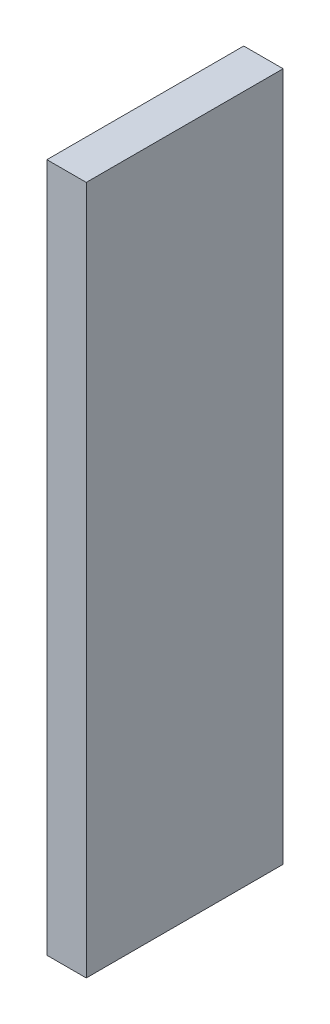
ISO-10303-21;
HEADER;
FILE_DESCRIPTION(('STEP AP214'),'2;1');
FILE_NAME('part.step','',(''),(''),'','','');
FILE_SCHEMA(('AUTOMOTIVE_DESIGN { 1 0 10303 214 1 1 1 1 }'));
ENDSEC;
DATA;
#1=APPLICATION_CONTEXT('core data for automotive mechanical design processes');
#2=APPLICATION_PROTOCOL_DEFINITION('international standard','automotive_design',2000,#1);
#3=PRODUCT_CONTEXT('',#1,'mechanical');
#4=PRODUCT('Part','Part','',(#3));
#5=PRODUCT_RELATED_PRODUCT_CATEGORY('part','',(#4));
#6=PRODUCT_DEFINITION_FORMATION('','',#4);
#7=PRODUCT_DEFINITION_CONTEXT('part definition',#1,'design');
#8=PRODUCT_DEFINITION('design','',#6,#7);
#9=PRODUCT_DEFINITION_SHAPE('','',#8);
#10=(LENGTH_UNIT() NAMED_UNIT(*) SI_UNIT(.MILLI.,.METRE.));
#11=(NAMED_UNIT(*) PLANE_ANGLE_UNIT() SI_UNIT($,.RADIAN.));
#12=(NAMED_UNIT(*) SI_UNIT($,.STERADIAN.) SOLID_ANGLE_UNIT());
#13=UNCERTAINTY_MEASURE_WITH_UNIT(LENGTH_MEASURE(1.E-05),#10,'distance_accuracy_value','');
#14=(GEOMETRIC_REPRESENTATION_CONTEXT(3) GLOBAL_UNCERTAINTY_ASSIGNED_CONTEXT((#13)) GLOBAL_UNIT_ASSIGNED_CONTEXT((#10,
#11,#12)) REPRESENTATION_CONTEXT('',''));
#15=CARTESIAN_POINT('',(0.,0.,0.));
#16=DIRECTION('',(0.,0.,1.));
#17=DIRECTION('',(1.,0.,0.));
#18=AXIS2_PLACEMENT_3D('',#15,#16,#17);
#19=CARTESIAN_POINT('',(0.,35.,20.));
#20=DIRECTION('',(-1.,0.,0.));
#21=DIRECTION('',(0.,0.,1.));
#22=AXIS2_PLACEMENT_3D('',#19,#20,#21);
#23=PLANE('',#22);
#24=DIRECTION('',(0.,1.,0.));
#25=VECTOR('',#24,1.);
#26=CARTESIAN_POINT('',(0.,35.,0.));
#27=LINE('',#26,#25);
#28=CARTESIAN_POINT('',(0.,-35.,0.));
#29=VERTEX_POINT('',#28);
#30=CARTESIAN_POINT('',(0.,35.,0.));
#31=VERTEX_POINT('',#30);
#32=EDGE_CURVE('E107',#29,#31,#27,.T.);
#33=ORIENTED_EDGE('',*,*,#32,.T.);
#34=DIRECTION('',(0.,0.,-1.));
#35=VECTOR('',#34,1.);
#36=CARTESIAN_POINT('',(0.,35.,20.));
#37=LINE('',#36,#35);
#38=CARTESIAN_POINT('',(0.,35.,20.));
#39=VERTEX_POINT('',#38);
#40=EDGE_CURVE('E11',#39,#31,#37,.T.);
#41=ORIENTED_EDGE('',*,*,#40,.F.);
#42=DIRECTION('',(0.,1.,0.));
#43=VECTOR('',#42,1.);
#44=CARTESIAN_POINT('',(0.,35.,20.));
#45=LINE('',#44,#43);
#46=CARTESIAN_POINT('',(0.,-35.,20.));
#47=VERTEX_POINT('',#46);
#48=EDGE_CURVE('E91',#47,#39,#45,.T.);
#49=ORIENTED_EDGE('',*,*,#48,.F.);
#50=DIRECTION('',(0.,0.,-1.));
#51=VECTOR('',#50,1.);
#52=CARTESIAN_POINT('',(0.,-35.,20.));
#53=LINE('',#52,#51);
#54=EDGE_CURVE('E103',#47,#29,#53,.T.);
#55=ORIENTED_EDGE('',*,*,#54,.T.);
#56=EDGE_LOOP('',(#33,#41,#49,#55));
#57=FACE_BOUND('',#56,.T.);
#58=ADVANCED_FACE('F39',(#57),#23,.F.);
#59=CARTESIAN_POINT('',(0.,35.,20.));
#60=DIRECTION('',(0.,-1.,0.));
#61=DIRECTION('',(0.,0.,-1.));
#62=AXIS2_PLACEMENT_3D('',#59,#60,#61);
#63=PLANE('',#62);
#64=DIRECTION('',(-1.,0.,0.));
#65=VECTOR('',#64,1.);
#66=CARTESIAN_POINT('',(0.,35.,0.));
#67=LINE('',#66,#65);
#68=CARTESIAN_POINT('',(-4.,35.,0.));
#69=VERTEX_POINT('',#68);
#70=EDGE_CURVE('E96',#31,#69,#67,.T.);
#71=ORIENTED_EDGE('',*,*,#70,.T.);
#72=DIRECTION('',(0.,0.,-1.));
#73=VECTOR('',#72,1.);
#74=CARTESIAN_POINT('',(-4.,35.,20.));
#75=LINE('',#74,#73);
#76=CARTESIAN_POINT('',(-4.,35.,20.));
#77=VERTEX_POINT('',#76);
#78=EDGE_CURVE('E48',#77,#69,#75,.T.);
#79=ORIENTED_EDGE('',*,*,#78,.F.);
#80=DIRECTION('',(-1.,0.,0.));
#81=VECTOR('',#80,1.);
#82=CARTESIAN_POINT('',(0.,35.,20.));
#83=LINE('',#82,#81);
#84=EDGE_CURVE('E86',#39,#77,#83,.T.);
#85=ORIENTED_EDGE('',*,*,#84,.F.);
#86=ORIENTED_EDGE('',*,*,#40,.T.);
#87=EDGE_LOOP('',(#71,#79,#85,#86));
#88=FACE_BOUND('',#87,.T.);
#89=ADVANCED_FACE('F95',(#88),#63,.F.);
#90=CARTESIAN_POINT('',(-4.,35.,20.));
#91=DIRECTION('',(1.,0.,0.));
#92=DIRECTION('',(0.,1.,0.));
#93=AXIS2_PLACEMENT_3D('',#90,#91,#92);
#94=PLANE('',#93);
#95=DIRECTION('',(0.,-1.,0.));
#96=VECTOR('',#95,1.);
#97=CARTESIAN_POINT('',(-4.,35.,0.));
#98=LINE('',#97,#96);
#99=CARTESIAN_POINT('',(-4.00000000000001,-35.,0.));
#100=VERTEX_POINT('',#99);
#101=EDGE_CURVE('E73',#69,#100,#98,.T.);
#102=ORIENTED_EDGE('',*,*,#101,.T.);
#103=DIRECTION('',(0.,0.,-1.));
#104=VECTOR('',#103,1.);
#105=CARTESIAN_POINT('',(-4.00000000000001,-35.,20.));
#106=LINE('',#105,#104);
#107=CARTESIAN_POINT('',(-4.00000000000001,-35.,20.));
#108=VERTEX_POINT('',#107);
#109=EDGE_CURVE('E98',#108,#100,#106,.T.);
#110=ORIENTED_EDGE('',*,*,#109,.F.);
#111=DIRECTION('',(0.,-1.,0.));
#112=VECTOR('',#111,1.);
#113=CARTESIAN_POINT('',(-4.,35.,20.));
#114=LINE('',#113,#112);
#115=EDGE_CURVE('E89',#77,#108,#114,.T.);
#116=ORIENTED_EDGE('',*,*,#115,.F.);
#117=ORIENTED_EDGE('',*,*,#78,.T.);
#118=EDGE_LOOP('',(#102,#110,#116,#117));
#119=FACE_BOUND('',#118,.T.);
#120=ADVANCED_FACE('F99',(#119),#94,.F.);
#121=CARTESIAN_POINT('',(0.,-35.,20.));
#122=DIRECTION('',(0.,1.,0.));
#123=DIRECTION('',(0.,0.,1.));
#124=AXIS2_PLACEMENT_3D('',#121,#122,#123);
#125=PLANE('',#124);
#126=DIRECTION('',(1.,0.,0.));
#127=VECTOR('',#126,1.);
#128=CARTESIAN_POINT('',(0.,-35.,0.));
#129=LINE('',#128,#127);
#130=EDGE_CURVE('E79',#100,#29,#129,.T.);
#131=ORIENTED_EDGE('',*,*,#130,.T.);
#132=ORIENTED_EDGE('',*,*,#54,.F.);
#133=DIRECTION('',(1.,0.,0.));
#134=VECTOR('',#133,1.);
#135=CARTESIAN_POINT('',(0.,-35.,20.));
#136=LINE('',#135,#134);
#137=EDGE_CURVE('E56',#108,#47,#136,.T.);
#138=ORIENTED_EDGE('',*,*,#137,.F.);
#139=ORIENTED_EDGE('',*,*,#109,.T.);
#140=EDGE_LOOP('',(#131,#132,#138,#139));
#141=FACE_BOUND('',#140,.T.);
#142=ADVANCED_FACE('F120',(#141),#125,.F.);
#143=CARTESIAN_POINT('',(0.,0.,20.));
#144=DIRECTION('',(0.,0.,-1.));
#145=DIRECTION('',(-1.,0.,0.));
#146=AXIS2_PLACEMENT_3D('',#143,#144,#145);
#147=PLANE('',#146);
#148=ORIENTED_EDGE('',*,*,#48,.T.);
#149=ORIENTED_EDGE('',*,*,#84,.T.);
#150=ORIENTED_EDGE('',*,*,#115,.T.);
#151=ORIENTED_EDGE('',*,*,#137,.T.);
#152=EDGE_LOOP('',(#148,#149,#150,#151));
#153=FACE_BOUND('',#152,.T.);
#154=ADVANCED_FACE('F87',(#153),#147,.F.);
#155=CARTESIAN_POINT('',(0.,0.,0.));
#156=DIRECTION('',(0.,0.,-1.));
#157=DIRECTION('',(-1.,0.,0.));
#158=AXIS2_PLACEMENT_3D('',#155,#156,#157);
#159=PLANE('',#158);
#160=ORIENTED_EDGE('',*,*,#32,.F.);
#161=ORIENTED_EDGE('',*,*,#130,.F.);
#162=ORIENTED_EDGE('',*,*,#101,.F.);
#163=ORIENTED_EDGE('',*,*,#70,.F.);
#164=EDGE_LOOP('',(#160,#161,#162,#163));
#165=FACE_BOUND('',#164,.T.);
#166=ADVANCED_FACE('F123',(#165),#159,.T.);
#167=CLOSED_SHELL('',(#58,#89,#120,#142,#154,#166));
#168=MANIFOLD_SOLID_BREP('B2',#167);
#169=ADVANCED_BREP_SHAPE_REPRESENTATION('',(#18,#168),#14);
#170=SHAPE_DEFINITION_REPRESENTATION(#9,#169);
ENDSEC;
END-ISO-10303-21;
